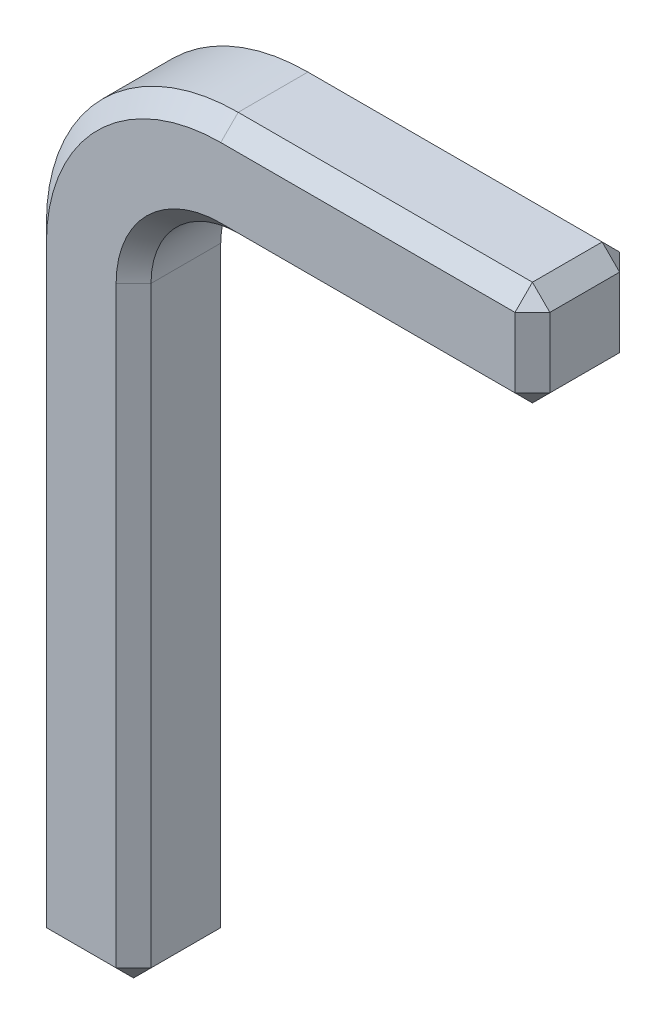
ISO-10303-21;
HEADER;
FILE_DESCRIPTION(('STEP AP214'),'2;1');
FILE_NAME('part.step','',(''),(''),'','','');
FILE_SCHEMA(('AUTOMOTIVE_DESIGN { 1 0 10303 214 1 1 1 1 }'));
ENDSEC;
DATA;
#1=APPLICATION_CONTEXT('core data for automotive mechanical design processes');
#2=APPLICATION_PROTOCOL_DEFINITION('international standard','automotive_design',2000,#1);
#3=PRODUCT_CONTEXT('',#1,'mechanical');
#4=PRODUCT('Part','Part','',(#3));
#5=PRODUCT_RELATED_PRODUCT_CATEGORY('part','',(#4));
#6=PRODUCT_DEFINITION_FORMATION('','',#4);
#7=PRODUCT_DEFINITION_CONTEXT('part definition',#1,'design');
#8=PRODUCT_DEFINITION('design','',#6,#7);
#9=PRODUCT_DEFINITION_SHAPE('','',#8);
#10=(LENGTH_UNIT() NAMED_UNIT(*) SI_UNIT(.MILLI.,.METRE.));
#11=(NAMED_UNIT(*) PLANE_ANGLE_UNIT() SI_UNIT($,.RADIAN.));
#12=(NAMED_UNIT(*) SI_UNIT($,.STERADIAN.) SOLID_ANGLE_UNIT());
#13=UNCERTAINTY_MEASURE_WITH_UNIT(LENGTH_MEASURE(1.E-05),#10,'distance_accuracy_value','');
#14=(GEOMETRIC_REPRESENTATION_CONTEXT(3) GLOBAL_UNCERTAINTY_ASSIGNED_CONTEXT((#13)) GLOBAL_UNIT_ASSIGNED_CONTEXT((#10,
#11,#12)) REPRESENTATION_CONTEXT('',''));
#15=CARTESIAN_POINT('',(0.,0.,0.));
#16=DIRECTION('',(0.,0.,1.));
#17=DIRECTION('',(1.,0.,0.));
#18=AXIS2_PLACEMENT_3D('',#15,#16,#17);
#19=CARTESIAN_POINT('',(-0.6,0.,0.3));
#20=DIRECTION('',(0.,1.,0.));
#21=DIRECTION('',(0.,0.,1.));
#22=AXIS2_PLACEMENT_3D('',#19,#20,#21);
#23=PLANE('',#22);
#24=DIRECTION('',(-1.,0.,0.));
#25=VECTOR('',#24,1.);
#26=CARTESIAN_POINT('',(-0.6,0.,0.200000000000001));
#27=LINE('',#26,#25);
#28=CARTESIAN_POINT('',(-0.0999999999999994,0.,0.200000000000001));
#29=VERTEX_POINT('',#28);
#30=CARTESIAN_POINT('',(-0.500000000000001,0.,0.200000000000001));
#31=VERTEX_POINT('',#30);
#32=EDGE_CURVE('E272',#29,#31,#27,.T.);
#33=ORIENTED_EDGE('',*,*,#32,.T.);
#34=DIRECTION('',(0.,0.,-1.));
#35=VECTOR('',#34,1.);
#36=CARTESIAN_POINT('',(-0.500000000000001,0.,0.3));
#37=LINE('',#36,#35);
#38=CARTESIAN_POINT('',(-0.500000000000001,0.,-0.200000000000001));
#39=VERTEX_POINT('',#38);
#40=EDGE_CURVE('E274',#31,#39,#37,.T.);
#41=ORIENTED_EDGE('',*,*,#40,.T.);
#42=DIRECTION('',(1.,0.,0.));
#43=VECTOR('',#42,1.);
#44=CARTESIAN_POINT('',(0.,0.,-0.200000000000001));
#45=LINE('',#44,#43);
#46=CARTESIAN_POINT('',(-0.0999999999999994,0.,-0.200000000000001));
#47=VERTEX_POINT('',#46);
#48=EDGE_CURVE('E270',#39,#47,#45,.T.);
#49=ORIENTED_EDGE('',*,*,#48,.T.);
#50=DIRECTION('',(0.,0.,1.));
#51=VECTOR('',#50,1.);
#52=CARTESIAN_POINT('',(-0.0999999999999994,0.,0.3));
#53=LINE('',#52,#51);
#54=EDGE_CURVE('E268',#47,#29,#53,.T.);
#55=ORIENTED_EDGE('',*,*,#54,.T.);
#56=EDGE_LOOP('',(#33,#41,#49,#55));
#57=FACE_BOUND('',#56,.T.);
#58=ADVANCED_FACE('F32',(#57),#23,.F.);
#59=CARTESIAN_POINT('',(0.,0.,0.3));
#60=DIRECTION('',(-1.,0.,0.));
#61=DIRECTION('',(0.,0.,1.));
#62=AXIS2_PLACEMENT_3D('',#59,#60,#61);
#63=PLANE('',#62);
#64=DIRECTION('',(0.,0.,-1.));
#65=VECTOR('',#64,1.);
#66=CARTESIAN_POINT('',(0.,0.0999999999999994,0.3));
#67=LINE('',#66,#65);
#68=CARTESIAN_POINT('',(0.,0.0999999999999994,0.200000000000001));
#69=VERTEX_POINT('',#68);
#70=CARTESIAN_POINT('',(0.,0.0999999999999994,-0.200000000000001));
#71=VERTEX_POINT('',#70);
#72=EDGE_CURVE('E206',#69,#71,#67,.T.);
#73=ORIENTED_EDGE('',*,*,#72,.T.);
#74=DIRECTION('',(0.,1.,0.));
#75=VECTOR('',#74,1.);
#76=CARTESIAN_POINT('',(0.,3.5,-0.200000000000001));
#77=LINE('',#76,#75);
#78=CARTESIAN_POINT('',(0.,3.5,-0.200000000000001));
#79=VERTEX_POINT('',#78);
#80=EDGE_CURVE('E190',#71,#79,#77,.T.);
#81=ORIENTED_EDGE('',*,*,#80,.T.);
#82=DIRECTION('',(0.,0.,-1.));
#83=VECTOR('',#82,1.);
#84=CARTESIAN_POINT('',(0.,3.5,0.3));
#85=LINE('',#84,#83);
#86=CARTESIAN_POINT('',(0.,3.5,0.200000000000001));
#87=VERTEX_POINT('',#86);
#88=EDGE_CURVE('E173',#87,#79,#85,.T.);
#89=ORIENTED_EDGE('',*,*,#88,.F.);
#90=DIRECTION('',(0.,-1.,0.));
#91=VECTOR('',#90,1.);
#92=CARTESIAN_POINT('',(0.,0.,0.200000000000001));
#93=LINE('',#92,#91);
#94=EDGE_CURVE('E187',#87,#69,#93,.T.);
#95=ORIENTED_EDGE('',*,*,#94,.T.);
#96=EDGE_LOOP('',(#73,#81,#89,#95));
#97=FACE_BOUND('',#96,.T.);
#98=ADVANCED_FACE('F185',(#97),#63,.F.);
#99=CARTESIAN_POINT('',(0.5,3.5,0.3));
#100=DIRECTION('',(0.,0.,-1.));
#101=DIRECTION('',(-1.,0.,0.));
#102=AXIS2_PLACEMENT_3D('',#99,#100,#101);
#103=CYLINDRICAL_SURFACE('',#102,0.5);
#104=ORIENTED_EDGE('',*,*,#88,.T.);
#105=CARTESIAN_POINT('',(0.5,3.5,-0.200000000000001));
#106=DIRECTION('',(0.,0.,-1.));
#107=DIRECTION('',(-1.,0.,0.));
#108=AXIS2_PLACEMENT_3D('',#105,#106,#107);
#109=CIRCLE('',#108,0.5);
#110=CARTESIAN_POINT('',(0.5,4.,-0.200000000000001));
#111=VERTEX_POINT('',#110);
#112=EDGE_CURVE('E180',#79,#111,#109,.T.);
#113=ORIENTED_EDGE('',*,*,#112,.T.);
#114=DIRECTION('',(0.,0.,-1.));
#115=VECTOR('',#114,1.);
#116=CARTESIAN_POINT('',(0.5,4.,0.3));
#117=LINE('',#116,#115);
#118=CARTESIAN_POINT('',(0.5,4.,0.200000000000001));
#119=VERTEX_POINT('',#118);
#120=EDGE_CURVE('E175',#119,#111,#117,.T.);
#121=ORIENTED_EDGE('',*,*,#120,.F.);
#122=CARTESIAN_POINT('',(0.5,3.5,0.200000000000001));
#123=DIRECTION('',(0.,0.,-1.));
#124=DIRECTION('',(-1.,0.,0.));
#125=AXIS2_PLACEMENT_3D('',#122,#123,#124);
#126=CIRCLE('',#125,0.5);
#127=EDGE_CURVE('E170',#119,#87,#126,.F.);
#128=ORIENTED_EDGE('',*,*,#127,.T.);
#129=EDGE_LOOP('',(#104,#113,#121,#128));
#130=FACE_BOUND('',#129,.T.);
#131=ADVANCED_FACE('F172',(#130),#103,.F.);
#132=CARTESIAN_POINT('',(0.5,4.,0.3));
#133=DIRECTION('',(0.,1.,0.));
#134=DIRECTION('',(0.,0.,1.));
#135=AXIS2_PLACEMENT_3D('',#132,#133,#134);
#136=PLANE('',#135);
#137=ORIENTED_EDGE('',*,*,#120,.T.);
#138=DIRECTION('',(1.,0.,0.));
#139=VECTOR('',#138,1.);
#140=CARTESIAN_POINT('',(2.28769588706264,4.,-0.200000000000001));
#141=LINE('',#140,#139);
#142=CARTESIAN_POINT('',(2.18769588706264,4.,-0.200000000000001));
#143=VERTEX_POINT('',#142);
#144=EDGE_CURVE('E233',#111,#143,#141,.T.);
#145=ORIENTED_EDGE('',*,*,#144,.T.);
#146=DIRECTION('',(0.,0.,1.));
#147=VECTOR('',#146,1.);
#148=CARTESIAN_POINT('',(2.18769588706264,4.,0.3));
#149=LINE('',#148,#147);
#150=CARTESIAN_POINT('',(2.18769588706264,4.,0.200000000000001));
#151=VERTEX_POINT('',#150);
#152=EDGE_CURVE('E229',#143,#151,#149,.T.);
#153=ORIENTED_EDGE('',*,*,#152,.T.);
#154=DIRECTION('',(-1.,0.,0.));
#155=VECTOR('',#154,1.);
#156=CARTESIAN_POINT('',(0.5,4.,0.200000000000001));
#157=LINE('',#156,#155);
#158=EDGE_CURVE('E231',#151,#119,#157,.T.);
#159=ORIENTED_EDGE('',*,*,#158,.T.);
#160=EDGE_LOOP('',(#137,#145,#153,#159));
#161=FACE_BOUND('',#160,.T.);
#162=ADVANCED_FACE('F380',(#161),#136,.F.);
#163=CARTESIAN_POINT('',(2.28769588706264,4.6,0.3));
#164=DIRECTION('',(-1.,0.,0.));
#165=DIRECTION('',(0.,0.,1.));
#166=AXIS2_PLACEMENT_3D('',#163,#164,#165);
#167=PLANE('',#166);
#168=DIRECTION('',(0.,-1.,0.));
#169=VECTOR('',#168,1.);
#170=CARTESIAN_POINT('',(2.28769588706264,4.6,0.200000000000001));
#171=LINE('',#170,#169);
#172=CARTESIAN_POINT('',(2.28769588706264,4.5,0.200000000000001));
#173=VERTEX_POINT('',#172);
#174=CARTESIAN_POINT('',(2.28769588706264,4.1,0.200000000000001));
#175=VERTEX_POINT('',#174);
#176=EDGE_CURVE('E41',#173,#175,#171,.T.);
#177=ORIENTED_EDGE('',*,*,#176,.T.);
#178=DIRECTION('',(0.,0.,-1.));
#179=VECTOR('',#178,1.);
#180=CARTESIAN_POINT('',(2.28769588706264,4.1,0.3));
#181=LINE('',#180,#179);
#182=CARTESIAN_POINT('',(2.28769588706264,4.1,-0.200000000000001));
#183=VERTEX_POINT('',#182);
#184=EDGE_CURVE('E11',#175,#183,#181,.T.);
#185=ORIENTED_EDGE('',*,*,#184,.T.);
#186=DIRECTION('',(0.,1.,0.));
#187=VECTOR('',#186,1.);
#188=CARTESIAN_POINT('',(2.28769588706264,4.6,-0.200000000000001));
#189=LINE('',#188,#187);
#190=CARTESIAN_POINT('',(2.28769588706264,4.5,-0.200000000000001));
#191=VERTEX_POINT('',#190);
#192=EDGE_CURVE('E277',#183,#191,#189,.T.);
#193=ORIENTED_EDGE('',*,*,#192,.T.);
#194=DIRECTION('',(0.,0.,1.));
#195=VECTOR('',#194,1.);
#196=CARTESIAN_POINT('',(2.28769588706264,4.5,0.3));
#197=LINE('',#196,#195);
#198=EDGE_CURVE('E52',#191,#173,#197,.T.);
#199=ORIENTED_EDGE('',*,*,#198,.T.);
#200=EDGE_LOOP('',(#177,#185,#193,#199));
#201=FACE_BOUND('',#200,.T.);
#202=ADVANCED_FACE('F580',(#201),#167,.F.);
#203=CARTESIAN_POINT('',(0.5,4.6,0.3));
#204=DIRECTION('',(0.,-1.,0.));
#205=DIRECTION('',(0.,0.,-1.));
#206=AXIS2_PLACEMENT_3D('',#203,#204,#205);
#207=PLANE('',#206);
#208=DIRECTION('',(0.,0.,-1.));
#209=VECTOR('',#208,1.);
#210=CARTESIAN_POINT('',(2.18769588706264,4.6,0.3));
#211=LINE('',#210,#209);
#212=CARTESIAN_POINT('',(2.18769588706264,4.6,0.200000000000001));
#213=VERTEX_POINT('',#212);
#214=CARTESIAN_POINT('',(2.18769588706264,4.6,-0.200000000000001));
#215=VERTEX_POINT('',#214);
#216=EDGE_CURVE('E235',#213,#215,#211,.T.);
#217=ORIENTED_EDGE('',*,*,#216,.T.);
#218=DIRECTION('',(-1.,0.,0.));
#219=VECTOR('',#218,1.);
#220=CARTESIAN_POINT('',(0.5,4.6,-0.200000000000001));
#221=LINE('',#220,#219);
#222=CARTESIAN_POINT('',(0.5,4.6,-0.200000000000001));
#223=VERTEX_POINT('',#222);
#224=EDGE_CURVE('E239',#215,#223,#221,.T.);
#225=ORIENTED_EDGE('',*,*,#224,.T.);
#226=DIRECTION('',(0.,0.,-1.));
#227=VECTOR('',#226,1.);
#228=CARTESIAN_POINT('',(0.5,4.6,0.3));
#229=LINE('',#228,#227);
#230=CARTESIAN_POINT('',(0.5,4.6,0.200000000000001));
#231=VERTEX_POINT('',#230);
#232=EDGE_CURVE('E371',#231,#223,#229,.T.);
#233=ORIENTED_EDGE('',*,*,#232,.F.);
#234=DIRECTION('',(1.,0.,0.));
#235=VECTOR('',#234,1.);
#236=CARTESIAN_POINT('',(0.5,4.6,0.200000000000001));
#237=LINE('',#236,#235);
#238=EDGE_CURVE('E237',#231,#213,#237,.T.);
#239=ORIENTED_EDGE('',*,*,#238,.T.);
#240=EDGE_LOOP('',(#217,#225,#233,#239));
#241=FACE_BOUND('',#240,.T.);
#242=ADVANCED_FACE('F445',(#241),#207,.F.);
#243=CARTESIAN_POINT('',(0.5,3.5,0.3));
#244=DIRECTION('',(0.,0.,-1.));
#245=DIRECTION('',(-1.,0.,0.));
#246=AXIS2_PLACEMENT_3D('',#243,#244,#245);
#247=CYLINDRICAL_SURFACE('',#246,1.1);
#248=ORIENTED_EDGE('',*,*,#232,.T.);
#249=CARTESIAN_POINT('',(0.5,3.5,-0.200000000000001));
#250=DIRECTION('',(0.,0.,-1.));
#251=DIRECTION('',(-1.,0.,0.));
#252=AXIS2_PLACEMENT_3D('',#249,#250,#251);
#253=CIRCLE('',#252,1.1);
#254=CARTESIAN_POINT('',(-0.6,3.5,-0.200000000000001));
#255=VERTEX_POINT('',#254);
#256=EDGE_CURVE('E244',#223,#255,#253,.F.);
#257=ORIENTED_EDGE('',*,*,#256,.T.);
#258=DIRECTION('',(0.,0.,-1.));
#259=VECTOR('',#258,1.);
#260=CARTESIAN_POINT('',(-0.6,3.5,0.3));
#261=LINE('',#260,#259);
#262=CARTESIAN_POINT('',(-0.6,3.5,0.200000000000001));
#263=VERTEX_POINT('',#262);
#264=EDGE_CURVE('E365',#263,#255,#261,.T.);
#265=ORIENTED_EDGE('',*,*,#264,.F.);
#266=CARTESIAN_POINT('',(0.5,3.5,0.200000000000001));
#267=DIRECTION('',(0.,0.,-1.));
#268=DIRECTION('',(-1.,0.,0.));
#269=AXIS2_PLACEMENT_3D('',#266,#267,#268);
#270=CIRCLE('',#269,1.1);
#271=EDGE_CURVE('E242',#263,#231,#270,.T.);
#272=ORIENTED_EDGE('',*,*,#271,.T.);
#273=EDGE_LOOP('',(#248,#257,#265,#272));
#274=FACE_BOUND('',#273,.T.);
#275=ADVANCED_FACE('F442',(#274),#247,.T.);
#276=CARTESIAN_POINT('',(-0.6,0.,0.3));
#277=DIRECTION('',(1.,0.,0.));
#278=DIRECTION('',(0.,0.,-1.));
#279=AXIS2_PLACEMENT_3D('',#276,#277,#278);
#280=PLANE('',#279);
#281=ORIENTED_EDGE('',*,*,#264,.T.);
#282=DIRECTION('',(0.,-1.,0.));
#283=VECTOR('',#282,1.);
#284=CARTESIAN_POINT('',(-0.6,0.,-0.200000000000001));
#285=LINE('',#284,#283);
#286=CARTESIAN_POINT('',(-0.6,0.0999999999999994,-0.200000000000001));
#287=VERTEX_POINT('',#286);
#288=EDGE_CURVE('E250',#255,#287,#285,.T.);
#289=ORIENTED_EDGE('',*,*,#288,.T.);
#290=DIRECTION('',(0.,0.,1.));
#291=VECTOR('',#290,1.);
#292=CARTESIAN_POINT('',(-0.6,0.0999999999999994,0.3));
#293=LINE('',#292,#291);
#294=CARTESIAN_POINT('',(-0.6,0.0999999999999994,0.200000000000001));
#295=VERTEX_POINT('',#294);
#296=EDGE_CURVE('E246',#287,#295,#293,.T.);
#297=ORIENTED_EDGE('',*,*,#296,.T.);
#298=DIRECTION('',(0.,1.,0.));
#299=VECTOR('',#298,1.);
#300=CARTESIAN_POINT('',(-0.6,0.,0.200000000000001));
#301=LINE('',#300,#299);
#302=EDGE_CURVE('E248',#295,#263,#301,.T.);
#303=ORIENTED_EDGE('',*,*,#302,.T.);
#304=EDGE_LOOP('',(#281,#289,#297,#303));
#305=FACE_BOUND('',#304,.T.);
#306=ADVANCED_FACE('F461',(#305),#280,.F.);
#307=CARTESIAN_POINT('',(0.5,3.5,0.3));
#308=DIRECTION('',(0.,0.,-1.));
#309=DIRECTION('',(-1.,0.,0.));
#310=AXIS2_PLACEMENT_3D('',#307,#308,#309);
#311=PLANE('',#310);
#312=CARTESIAN_POINT('',(0.5,3.5,0.3));
#313=DIRECTION('',(0.,0.,-1.));
#314=DIRECTION('',(-1.,0.,0.));
#315=AXIS2_PLACEMENT_3D('',#312,#313,#314);
#316=CIRCLE('',#315,1.);
#317=CARTESIAN_POINT('',(0.5,4.5,0.3));
#318=VERTEX_POINT('',#317);
#319=CARTESIAN_POINT('',(-0.5,3.5,0.3));
#320=VERTEX_POINT('',#319);
#321=EDGE_CURVE('E263',#318,#320,#316,.F.);
#322=ORIENTED_EDGE('',*,*,#321,.T.);
#323=DIRECTION('',(0.,-1.,0.));
#324=VECTOR('',#323,1.);
#325=CARTESIAN_POINT('',(-0.5,3.5,0.3));
#326=LINE('',#325,#324);
#327=CARTESIAN_POINT('',(-0.5,0.0999999999999994,0.3));
#328=VERTEX_POINT('',#327);
#329=EDGE_CURVE('E265',#320,#328,#326,.T.);
#330=ORIENTED_EDGE('',*,*,#329,.T.);
#331=DIRECTION('',(1.,0.,0.));
#332=VECTOR('',#331,1.);
#333=CARTESIAN_POINT('',(0.5,0.0999999999999994,0.3));
#334=LINE('',#333,#332);
#335=CARTESIAN_POINT('',(-0.0999999999999994,0.0999999999999994,0.3));
#336=VERTEX_POINT('',#335);
#337=EDGE_CURVE('E259',#328,#336,#334,.T.);
#338=ORIENTED_EDGE('',*,*,#337,.T.);
#339=DIRECTION('',(0.,1.,0.));
#340=VECTOR('',#339,1.);
#341=CARTESIAN_POINT('',(-0.0999999999999994,3.5,0.3));
#342=LINE('',#341,#340);
#343=CARTESIAN_POINT('',(-0.0999999999999994,3.5,0.3));
#344=VERTEX_POINT('',#343);
#345=EDGE_CURVE('E257',#336,#344,#342,.T.);
#346=ORIENTED_EDGE('',*,*,#345,.T.);
#347=CARTESIAN_POINT('',(0.5,3.5,0.3));
#348=DIRECTION('',(0.,0.,-1.));
#349=DIRECTION('',(-1.,0.,0.));
#350=AXIS2_PLACEMENT_3D('',#347,#348,#349);
#351=CIRCLE('',#350,0.599999999999999);
#352=CARTESIAN_POINT('',(0.5,4.1,0.3));
#353=VERTEX_POINT('',#352);
#354=EDGE_CURVE('E196',#344,#353,#351,.T.);
#355=ORIENTED_EDGE('',*,*,#354,.T.);
#356=DIRECTION('',(1.,0.,0.));
#357=VECTOR('',#356,1.);
#358=CARTESIAN_POINT('',(0.5,4.1,0.3));
#359=LINE('',#358,#357);
#360=CARTESIAN_POINT('',(2.18769588706264,4.1,0.3));
#361=VERTEX_POINT('',#360);
#362=EDGE_CURVE('E254',#353,#361,#359,.T.);
#363=ORIENTED_EDGE('',*,*,#362,.T.);
#364=DIRECTION('',(0.,1.,0.));
#365=VECTOR('',#364,1.);
#366=CARTESIAN_POINT('',(2.18769588706264,3.5,0.3));
#367=LINE('',#366,#365);
#368=CARTESIAN_POINT('',(2.18769588706264,4.5,0.3));
#369=VERTEX_POINT('',#368);
#370=EDGE_CURVE('E252',#361,#369,#367,.T.);
#371=ORIENTED_EDGE('',*,*,#370,.T.);
#372=DIRECTION('',(-1.,0.,0.));
#373=VECTOR('',#372,1.);
#374=CARTESIAN_POINT('',(0.5,4.5,0.3));
#375=LINE('',#374,#373);
#376=EDGE_CURVE('E261',#369,#318,#375,.T.);
#377=ORIENTED_EDGE('',*,*,#376,.T.);
#378=EDGE_LOOP('',(#322,#330,#338,#346,#355,#363,#371,#377));
#379=FACE_BOUND('',#378,.T.);
#380=ADVANCED_FACE('F436',(#379),#311,.F.);
#381=CARTESIAN_POINT('',(0.5,3.5,-0.3));
#382=DIRECTION('',(0.,0.,-1.));
#383=DIRECTION('',(-1.,0.,0.));
#384=AXIS2_PLACEMENT_3D('',#381,#382,#383);
#385=PLANE('',#384);
#386=DIRECTION('',(0.,1.,0.));
#387=VECTOR('',#386,1.);
#388=CARTESIAN_POINT('',(-0.5,3.5,-0.3));
#389=LINE('',#388,#387);
#390=CARTESIAN_POINT('',(-0.5,0.0999999999999994,-0.3));
#391=VERTEX_POINT('',#390);
#392=CARTESIAN_POINT('',(-0.5,3.5,-0.3));
#393=VERTEX_POINT('',#392);
#394=EDGE_CURVE('E225',#391,#393,#389,.T.);
#395=ORIENTED_EDGE('',*,*,#394,.T.);
#396=CARTESIAN_POINT('',(0.5,3.5,-0.3));
#397=DIRECTION('',(0.,0.,-1.));
#398=DIRECTION('',(-1.,0.,0.));
#399=AXIS2_PLACEMENT_3D('',#396,#397,#398);
#400=CIRCLE('',#399,1.);
#401=CARTESIAN_POINT('',(0.5,4.5,-0.3));
#402=VERTEX_POINT('',#401);
#403=EDGE_CURVE('E181',#393,#402,#400,.T.);
#404=ORIENTED_EDGE('',*,*,#403,.T.);
#405=DIRECTION('',(1.,0.,0.));
#406=VECTOR('',#405,1.);
#407=CARTESIAN_POINT('',(2.28769588706264,4.5,-0.3));
#408=LINE('',#407,#406);
#409=CARTESIAN_POINT('',(2.18769588706264,4.5,-0.3));
#410=VERTEX_POINT('',#409);
#411=EDGE_CURVE('E214',#402,#410,#408,.T.);
#412=ORIENTED_EDGE('',*,*,#411,.T.);
#413=DIRECTION('',(0.,-1.,0.));
#414=VECTOR('',#413,1.);
#415=CARTESIAN_POINT('',(2.18769588706264,4.,-0.3));
#416=LINE('',#415,#414);
#417=CARTESIAN_POINT('',(2.18769588706264,4.1,-0.3));
#418=VERTEX_POINT('',#417);
#419=EDGE_CURVE('E212',#410,#418,#416,.T.);
#420=ORIENTED_EDGE('',*,*,#419,.T.);
#421=DIRECTION('',(-1.,0.,0.));
#422=VECTOR('',#421,1.);
#423=CARTESIAN_POINT('',(0.5,4.1,-0.3));
#424=LINE('',#423,#422);
#425=CARTESIAN_POINT('',(0.5,4.1,-0.3));
#426=VERTEX_POINT('',#425);
#427=EDGE_CURVE('E216',#418,#426,#424,.T.);
#428=ORIENTED_EDGE('',*,*,#427,.T.);
#429=CARTESIAN_POINT('',(0.5,3.5,-0.3));
#430=DIRECTION('',(0.,0.,-1.));
#431=DIRECTION('',(-1.,0.,0.));
#432=AXIS2_PLACEMENT_3D('',#429,#430,#431);
#433=CIRCLE('',#432,0.599999999999999);
#434=CARTESIAN_POINT('',(-0.0999999999999994,3.5,-0.3));
#435=VERTEX_POINT('',#434);
#436=EDGE_CURVE('E218',#426,#435,#433,.F.);
#437=ORIENTED_EDGE('',*,*,#436,.T.);
#438=DIRECTION('',(0.,-1.,0.));
#439=VECTOR('',#438,1.);
#440=CARTESIAN_POINT('',(-0.0999999999999994,0.,-0.3));
#441=LINE('',#440,#439);
#442=CARTESIAN_POINT('',(-0.0999999999999994,0.0999999999999994,-0.3));
#443=VERTEX_POINT('',#442);
#444=EDGE_CURVE('E220',#435,#443,#441,.T.);
#445=ORIENTED_EDGE('',*,*,#444,.T.);
#446=DIRECTION('',(-1.,0.,0.));
#447=VECTOR('',#446,1.);
#448=CARTESIAN_POINT('',(-0.6,0.0999999999999994,-0.3));
#449=LINE('',#448,#447);
#450=EDGE_CURVE('E223',#443,#391,#449,.T.);
#451=ORIENTED_EDGE('',*,*,#450,.T.);
#452=EDGE_LOOP('',(#395,#404,#412,#420,#428,#437,#445,#451));
#453=FACE_BOUND('',#452,.T.);
#454=ADVANCED_FACE('F395',(#453),#385,.T.);
#455=CARTESIAN_POINT('',(0.5,4.5,0.3));
#456=DIRECTION('',(0.,-0.707106781186548,-0.707106781186548));
#457=DIRECTION('',(-1.,0.,0.));
#458=AXIS2_PLACEMENT_3D('',#455,#456,#457);
#459=PLANE('',#458);
#460=DIRECTION('',(0.,0.707106781186547,-0.707106781186547));
#461=VECTOR('',#460,1.);
#462=CARTESIAN_POINT('',(2.18769588706264,4.6,0.200000000000001));
#463=LINE('',#462,#461);
#464=EDGE_CURVE('E358',#213,#369,#463,.F.);
#465=ORIENTED_EDGE('',*,*,#464,.F.);
#466=ORIENTED_EDGE('',*,*,#238,.F.);
#467=DIRECTION('',(0.,0.707106781186548,-0.707106781186548));
#468=VECTOR('',#467,1.);
#469=CARTESIAN_POINT('',(0.5,4.5,0.3));
#470=LINE('',#469,#468);
#471=EDGE_CURVE('E36',#318,#231,#470,.T.);
#472=ORIENTED_EDGE('',*,*,#471,.F.);
#473=ORIENTED_EDGE('',*,*,#376,.F.);
#474=EDGE_LOOP('',(#465,#466,#472,#473));
#475=FACE_BOUND('',#474,.T.);
#476=ADVANCED_FACE('F34',(#475),#459,.F.);
#477=CARTESIAN_POINT('',(0.5,3.5,0.3));
#478=DIRECTION('',(0.,0.,-1.));
#479=DIRECTION('',(-1.,0.,0.));
#480=AXIS2_PLACEMENT_3D('',#477,#478,#479);
#481=CONICAL_SURFACE('',#480,1.,0.785398163397448);
#482=ORIENTED_EDGE('',*,*,#471,.T.);
#483=ORIENTED_EDGE('',*,*,#271,.F.);
#484=DIRECTION('',(-0.707106781186548,0.,-0.707106781186547));
#485=VECTOR('',#484,1.);
#486=CARTESIAN_POINT('',(-0.5,3.5,0.3));
#487=LINE('',#486,#485);
#488=EDGE_CURVE('E356',#320,#263,#487,.T.);
#489=ORIENTED_EDGE('',*,*,#488,.F.);
#490=ORIENTED_EDGE('',*,*,#321,.F.);
#491=EDGE_LOOP('',(#482,#483,#489,#490));
#492=FACE_BOUND('',#491,.T.);
#493=ADVANCED_FACE('F439',(#492),#481,.T.);
#494=CARTESIAN_POINT('',(2.18769588706264,4.6,0.200000000000001));
#495=DIRECTION('',(0.577350269189626,0.577350269189626,0.577350269189626));
#496=DIRECTION('',(0.707106781186548,0.,-0.707106781186548));
#497=AXIS2_PLACEMENT_3D('',#494,#495,#496);
#498=PLANE('',#497);
#499=DIRECTION('',(0.707106781186547,-0.707106781186547,0.));
#500=VECTOR('',#499,1.);
#501=CARTESIAN_POINT('',(2.18769588706264,4.6,0.200000000000001));
#502=LINE('',#501,#500);
#503=EDGE_CURVE('E351',#213,#173,#502,.T.);
#504=ORIENTED_EDGE('',*,*,#503,.F.);
#505=ORIENTED_EDGE('',*,*,#464,.T.);
#506=DIRECTION('',(-0.707106781186547,0.,0.707106781186547));
#507=VECTOR('',#506,1.);
#508=CARTESIAN_POINT('',(2.23769588706264,4.5,0.25));
#509=LINE('',#508,#507);
#510=EDGE_CURVE('E353',#173,#369,#509,.T.);
#511=ORIENTED_EDGE('',*,*,#510,.F.);
#512=EDGE_LOOP('',(#504,#505,#511));
#513=FACE_BOUND('',#512,.T.);
#514=ADVANCED_FACE('F449',(#513),#498,.T.);
#515=CARTESIAN_POINT('',(-0.5,3.5,0.3));
#516=DIRECTION('',(0.707106781186547,0.,-0.707106781186548));
#517=DIRECTION('',(0.,-1.,0.));
#518=AXIS2_PLACEMENT_3D('',#515,#516,#517);
#519=PLANE('',#518);
#520=ORIENTED_EDGE('',*,*,#488,.T.);
#521=ORIENTED_EDGE('',*,*,#302,.F.);
#522=DIRECTION('',(0.707106781186548,0.,0.707106781186547));
#523=VECTOR('',#522,1.);
#524=CARTESIAN_POINT('',(-0.5,0.0999999999999994,0.3));
#525=LINE('',#524,#523);
#526=EDGE_CURVE('E345',#328,#295,#525,.F.);
#527=ORIENTED_EDGE('',*,*,#526,.F.);
#528=ORIENTED_EDGE('',*,*,#329,.F.);
#529=EDGE_LOOP('',(#520,#521,#527,#528));
#530=FACE_BOUND('',#529,.T.);
#531=ADVANCED_FACE('F434',(#530),#519,.F.);
#532=CARTESIAN_POINT('',(0.5,4.1,0.3));
#533=DIRECTION('',(0.,0.707106781186548,-0.707106781186548));
#534=DIRECTION('',(1.,0.,0.));
#535=AXIS2_PLACEMENT_3D('',#532,#533,#534);
#536=PLANE('',#535);
#537=DIRECTION('',(0.,0.707106781186547,0.707106781186547));
#538=VECTOR('',#537,1.);
#539=CARTESIAN_POINT('',(2.18769588706264,4.1,0.3));
#540=LINE('',#539,#538);
#541=EDGE_CURVE('E340',#361,#151,#540,.F.);
#542=ORIENTED_EDGE('',*,*,#541,.F.);
#543=ORIENTED_EDGE('',*,*,#362,.F.);
#544=DIRECTION('',(0.,0.707106781186548,0.707106781186548));
#545=VECTOR('',#544,1.);
#546=CARTESIAN_POINT('',(0.5,4.,0.200000000000001));
#547=LINE('',#546,#545);
#548=EDGE_CURVE('E343',#119,#353,#547,.T.);
#549=ORIENTED_EDGE('',*,*,#548,.F.);
#550=ORIENTED_EDGE('',*,*,#158,.F.);
#551=EDGE_LOOP('',(#542,#543,#549,#550));
#552=FACE_BOUND('',#551,.T.);
#553=ADVANCED_FACE('F540',(#552),#536,.F.);
#554=CARTESIAN_POINT('',(2.18769588706264,3.5,0.3));
#555=DIRECTION('',(-0.707106781186548,0.,-0.707106781186548));
#556=DIRECTION('',(0.,1.,0.));
#557=AXIS2_PLACEMENT_3D('',#554,#555,#556);
#558=PLANE('',#557);
#559=ORIENTED_EDGE('',*,*,#510,.T.);
#560=ORIENTED_EDGE('',*,*,#370,.F.);
#561=DIRECTION('',(0.707106781186547,0.,-0.707106781186547));
#562=VECTOR('',#561,1.);
#563=CARTESIAN_POINT('',(2.18769588706264,4.1,0.3));
#564=LINE('',#563,#562);
#565=EDGE_CURVE('E337',#175,#361,#564,.F.);
#566=ORIENTED_EDGE('',*,*,#565,.F.);
#567=ORIENTED_EDGE('',*,*,#176,.F.);
#568=EDGE_LOOP('',(#559,#560,#566,#567));
#569=FACE_BOUND('',#568,.T.);
#570=ADVANCED_FACE('F537',(#569),#558,.F.);
#571=CARTESIAN_POINT('',(2.18769588706264,4.6,0.3));
#572=DIRECTION('',(-0.707106781186548,-0.707106781186548,0.));
#573=DIRECTION('',(0.,0.,-1.));
#574=AXIS2_PLACEMENT_3D('',#571,#572,#573);
#575=PLANE('',#574);
#576=ORIENTED_EDGE('',*,*,#503,.T.);
#577=ORIENTED_EDGE('',*,*,#198,.F.);
#578=DIRECTION('',(-0.707106781186547,0.707106781186547,0.));
#579=VECTOR('',#578,1.);
#580=CARTESIAN_POINT('',(2.23769588706264,4.55,-0.200000000000001));
#581=LINE('',#580,#579);
#582=EDGE_CURVE('E334',#215,#191,#581,.F.);
#583=ORIENTED_EDGE('',*,*,#582,.F.);
#584=ORIENTED_EDGE('',*,*,#216,.F.);
#585=EDGE_LOOP('',(#576,#577,#583,#584));
#586=FACE_BOUND('',#585,.T.);
#587=ADVANCED_FACE('F452',(#586),#575,.F.);
#588=CARTESIAN_POINT('',(0.5,4.6,-0.200000000000001));
#589=DIRECTION('',(0.,0.707106781186548,-0.707106781186548));
#590=DIRECTION('',(1.,0.,0.));
#591=AXIS2_PLACEMENT_3D('',#588,#589,#590);
#592=PLANE('',#591);
#593=DIRECTION('',(0.,0.707106781186547,0.707106781186547));
#594=VECTOR('',#593,1.);
#595=CARTESIAN_POINT('',(2.18769588706264,4.5,-0.3));
#596=LINE('',#595,#594);
#597=EDGE_CURVE('E331',#410,#215,#596,.T.);
#598=ORIENTED_EDGE('',*,*,#597,.F.);
#599=ORIENTED_EDGE('',*,*,#411,.F.);
#600=DIRECTION('',(0.,-0.707106781186548,-0.707106781186548));
#601=VECTOR('',#600,1.);
#602=CARTESIAN_POINT('',(0.5,4.6,-0.200000000000001));
#603=LINE('',#602,#601);
#604=EDGE_CURVE('E348',#223,#402,#603,.T.);
#605=ORIENTED_EDGE('',*,*,#604,.F.);
#606=ORIENTED_EDGE('',*,*,#224,.F.);
#607=EDGE_LOOP('',(#598,#599,#605,#606));
#608=FACE_BOUND('',#607,.T.);
#609=ADVANCED_FACE('F456',(#608),#592,.T.);
#610=CARTESIAN_POINT('',(0.5,3.5,-0.200000000000001));
#611=DIRECTION('',(0.,0.,1.));
#612=DIRECTION('',(1.,0.,0.));
#613=AXIS2_PLACEMENT_3D('',#610,#611,#612);
#614=CONICAL_SURFACE('',#613,1.1,0.785398163397448);
#615=ORIENTED_EDGE('',*,*,#604,.T.);
#616=ORIENTED_EDGE('',*,*,#403,.F.);
#617=DIRECTION('',(0.707106781186548,0.,-0.707106781186548));
#618=VECTOR('',#617,1.);
#619=CARTESIAN_POINT('',(-0.6,3.5,-0.200000000000001));
#620=LINE('',#619,#618);
#621=EDGE_CURVE('E328',#255,#393,#620,.T.);
#622=ORIENTED_EDGE('',*,*,#621,.F.);
#623=ORIENTED_EDGE('',*,*,#256,.F.);
#624=EDGE_LOOP('',(#615,#616,#622,#623));
#625=FACE_BOUND('',#624,.T.);
#626=ADVANCED_FACE('F460',(#625),#614,.T.);
#627=CARTESIAN_POINT('',(-0.5,0.0999999999999994,0.3));
#628=DIRECTION('',(-0.577350269189626,-0.577350269189626,0.577350269189626));
#629=DIRECTION('',(0.707106781186548,0.,0.707106781186547));
#630=AXIS2_PLACEMENT_3D('',#627,#628,#629);
#631=PLANE('',#630);
#632=DIRECTION('',(0.,-0.707106781186547,-0.707106781186547));
#633=VECTOR('',#632,1.);
#634=CARTESIAN_POINT('',(-0.5,0.0999999999999994,0.3));
#635=LINE('',#634,#633);
#636=EDGE_CURVE('E199',#328,#31,#635,.T.);
#637=ORIENTED_EDGE('',*,*,#636,.F.);
#638=ORIENTED_EDGE('',*,*,#526,.T.);
#639=DIRECTION('',(-0.707106781186548,0.707106781186548,0.));
#640=VECTOR('',#639,1.);
#641=CARTESIAN_POINT('',(-0.55,0.0499999999999996,0.200000000000001));
#642=LINE('',#641,#640);
#643=EDGE_CURVE('E325',#31,#295,#642,.T.);
#644=ORIENTED_EDGE('',*,*,#643,.F.);
#645=EDGE_LOOP('',(#637,#638,#644));
#646=FACE_BOUND('',#645,.T.);
#647=ADVANCED_FACE('F430',(#646),#631,.T.);
#648=CARTESIAN_POINT('',(0.5,3.5,0.3));
#649=DIRECTION('',(0.,0.,1.));
#650=DIRECTION('',(1.,0.,0.));
#651=AXIS2_PLACEMENT_3D('',#648,#649,#650);
#652=CONICAL_SURFACE('',#651,0.599999999999999,0.785398163397448);
#653=ORIENTED_EDGE('',*,*,#548,.T.);
#654=ORIENTED_EDGE('',*,*,#354,.F.);
#655=DIRECTION('',(-0.707106781186548,0.,0.707106781186548));
#656=VECTOR('',#655,1.);
#657=CARTESIAN_POINT('',(0.,3.5,0.200000000000001));
#658=LINE('',#657,#656);
#659=EDGE_CURVE('E194',#87,#344,#658,.T.);
#660=ORIENTED_EDGE('',*,*,#659,.F.);
#661=ORIENTED_EDGE('',*,*,#127,.F.);
#662=EDGE_LOOP('',(#653,#654,#660,#661));
#663=FACE_BOUND('',#662,.T.);
#664=ADVANCED_FACE('F195',(#663),#652,.F.);
#665=CARTESIAN_POINT('',(2.18769588706264,4.1,0.3));
#666=DIRECTION('',(0.577350269189626,-0.577350269189626,0.577350269189626));
#667=DIRECTION('',(0.707106781186548,0.,-0.707106781186548));
#668=AXIS2_PLACEMENT_3D('',#665,#666,#667);
#669=PLANE('',#668);
#670=ORIENTED_EDGE('',*,*,#565,.T.);
#671=ORIENTED_EDGE('',*,*,#541,.T.);
#672=DIRECTION('',(-0.707106781186547,-0.707106781186547,0.));
#673=VECTOR('',#672,1.);
#674=CARTESIAN_POINT('',(2.23769588706264,4.05,0.200000000000001));
#675=LINE('',#674,#673);
#676=EDGE_CURVE('E200',#175,#151,#675,.T.);
#677=ORIENTED_EDGE('',*,*,#676,.F.);
#678=EDGE_LOOP('',(#670,#671,#677));
#679=FACE_BOUND('',#678,.T.);
#680=ADVANCED_FACE('F522',(#679),#669,.T.);
#681=CARTESIAN_POINT('',(2.18769588706264,4.5,-0.3));
#682=DIRECTION('',(0.577350269189626,0.577350269189626,-0.577350269189626));
#683=DIRECTION('',(-0.707106781186548,0.,-0.707106781186548));
#684=AXIS2_PLACEMENT_3D('',#681,#682,#683);
#685=PLANE('',#684);
#686=ORIENTED_EDGE('',*,*,#597,.T.);
#687=ORIENTED_EDGE('',*,*,#582,.T.);
#688=DIRECTION('',(-0.707106781186547,0.,-0.707106781186547));
#689=VECTOR('',#688,1.);
#690=CARTESIAN_POINT('',(2.18769588706264,4.5,-0.3));
#691=LINE('',#690,#689);
#692=EDGE_CURVE('E318',#410,#191,#691,.F.);
#693=ORIENTED_EDGE('',*,*,#692,.F.);
#694=EDGE_LOOP('',(#686,#687,#693));
#695=FACE_BOUND('',#694,.T.);
#696=ADVANCED_FACE('F519',(#695),#685,.T.);
#697=CARTESIAN_POINT('',(-0.6,0.,-0.200000000000001));
#698=DIRECTION('',(-0.707106781186547,0.,-0.707106781186548));
#699=DIRECTION('',(0.,1.,0.));
#700=AXIS2_PLACEMENT_3D('',#697,#698,#699);
#701=PLANE('',#700);
#702=ORIENTED_EDGE('',*,*,#621,.T.);
#703=ORIENTED_EDGE('',*,*,#394,.F.);
#704=DIRECTION('',(0.707106781186548,0.,-0.707106781186547));
#705=VECTOR('',#704,1.);
#706=CARTESIAN_POINT('',(-0.6,0.0999999999999994,-0.200000000000001));
#707=LINE('',#706,#705);
#708=EDGE_CURVE('E315',#287,#391,#707,.T.);
#709=ORIENTED_EDGE('',*,*,#708,.F.);
#710=ORIENTED_EDGE('',*,*,#288,.F.);
#711=EDGE_LOOP('',(#702,#703,#709,#710));
#712=FACE_BOUND('',#711,.T.);
#713=ADVANCED_FACE('F411',(#712),#701,.T.);
#714=CARTESIAN_POINT('',(-0.500000000000001,0.,0.3));
#715=DIRECTION('',(0.707106781186548,0.707106781186548,0.));
#716=DIRECTION('',(0.,0.,-1.));
#717=AXIS2_PLACEMENT_3D('',#714,#715,#716);
#718=PLANE('',#717);
#719=ORIENTED_EDGE('',*,*,#643,.T.);
#720=ORIENTED_EDGE('',*,*,#296,.F.);
#721=DIRECTION('',(0.707106781186548,-0.707106781186548,0.));
#722=VECTOR('',#721,1.);
#723=CARTESIAN_POINT('',(-0.6,0.0999999999999994,-0.200000000000001));
#724=LINE('',#723,#722);
#725=EDGE_CURVE('E312',#39,#287,#724,.F.);
#726=ORIENTED_EDGE('',*,*,#725,.F.);
#727=ORIENTED_EDGE('',*,*,#40,.F.);
#728=EDGE_LOOP('',(#719,#720,#726,#727));
#729=FACE_BOUND('',#728,.T.);
#730=ADVANCED_FACE('F419',(#729),#718,.F.);
#731=CARTESIAN_POINT('',(0.5,0.0999999999999994,0.3));
#732=DIRECTION('',(0.,0.707106781186548,-0.707106781186548));
#733=DIRECTION('',(1.,0.,0.));
#734=AXIS2_PLACEMENT_3D('',#731,#732,#733);
#735=PLANE('',#734);
#736=ORIENTED_EDGE('',*,*,#636,.T.);
#737=ORIENTED_EDGE('',*,*,#32,.F.);
#738=DIRECTION('',(0.,0.707106781186547,0.707106781186547));
#739=VECTOR('',#738,1.);
#740=CARTESIAN_POINT('',(-0.0999999999999994,0.0999999999999994,0.3));
#741=LINE('',#740,#739);
#742=EDGE_CURVE('E309',#336,#29,#741,.F.);
#743=ORIENTED_EDGE('',*,*,#742,.F.);
#744=ORIENTED_EDGE('',*,*,#337,.F.);
#745=EDGE_LOOP('',(#736,#737,#743,#744));
#746=FACE_BOUND('',#745,.T.);
#747=ADVANCED_FACE('F427',(#746),#735,.F.);
#748=CARTESIAN_POINT('',(-0.0999999999999994,3.5,0.3));
#749=DIRECTION('',(-0.707106781186548,0.,-0.707106781186548));
#750=DIRECTION('',(0.,1.,0.));
#751=AXIS2_PLACEMENT_3D('',#748,#749,#750);
#752=PLANE('',#751);
#753=ORIENTED_EDGE('',*,*,#659,.T.);
#754=ORIENTED_EDGE('',*,*,#345,.F.);
#755=DIRECTION('',(0.707106781186547,0.,-0.707106781186547));
#756=VECTOR('',#755,1.);
#757=CARTESIAN_POINT('',(-0.0999999999999994,0.0999999999999994,0.3));
#758=LINE('',#757,#756);
#759=EDGE_CURVE('E204',#69,#336,#758,.F.);
#760=ORIENTED_EDGE('',*,*,#759,.F.);
#761=ORIENTED_EDGE('',*,*,#94,.F.);
#762=EDGE_LOOP('',(#753,#754,#760,#761));
#763=FACE_BOUND('',#762,.T.);
#764=ADVANCED_FACE('F202',(#763),#752,.F.);
#765=CARTESIAN_POINT('',(2.28769588706264,4.1,0.3));
#766=DIRECTION('',(-0.707106781186548,0.707106781186548,0.));
#767=DIRECTION('',(0.,0.,-1.));
#768=AXIS2_PLACEMENT_3D('',#765,#766,#767);
#769=PLANE('',#768);
#770=ORIENTED_EDGE('',*,*,#676,.T.);
#771=ORIENTED_EDGE('',*,*,#152,.F.);
#772=DIRECTION('',(0.707106781186547,0.707106781186547,0.));
#773=VECTOR('',#772,1.);
#774=CARTESIAN_POINT('',(2.18769588706264,4.,-0.200000000000001));
#775=LINE('',#774,#773);
#776=EDGE_CURVE('E305',#183,#143,#775,.F.);
#777=ORIENTED_EDGE('',*,*,#776,.F.);
#778=ORIENTED_EDGE('',*,*,#184,.F.);
#779=EDGE_LOOP('',(#770,#771,#777,#778));
#780=FACE_BOUND('',#779,.T.);
#781=ADVANCED_FACE('F506',(#780),#769,.F.);
#782=CARTESIAN_POINT('',(2.28769588706264,4.6,-0.200000000000001));
#783=DIRECTION('',(0.707106781186548,0.,-0.707106781186548));
#784=DIRECTION('',(0.,-1.,0.));
#785=AXIS2_PLACEMENT_3D('',#782,#783,#784);
#786=PLANE('',#785);
#787=ORIENTED_EDGE('',*,*,#692,.T.);
#788=ORIENTED_EDGE('',*,*,#192,.F.);
#789=DIRECTION('',(0.707106781186547,0.,0.707106781186547));
#790=VECTOR('',#789,1.);
#791=CARTESIAN_POINT('',(2.23769588706264,4.1,-0.25));
#792=LINE('',#791,#790);
#793=EDGE_CURVE('E303',#418,#183,#792,.T.);
#794=ORIENTED_EDGE('',*,*,#793,.F.);
#795=ORIENTED_EDGE('',*,*,#419,.F.);
#796=EDGE_LOOP('',(#787,#788,#794,#795));
#797=FACE_BOUND('',#796,.T.);
#798=ADVANCED_FACE('F503',(#797),#786,.T.);
#799=CARTESIAN_POINT('',(-0.6,0.0999999999999994,-0.200000000000001));
#800=DIRECTION('',(-0.577350269189626,-0.577350269189626,-0.577350269189626));
#801=DIRECTION('',(-0.707106781186548,0.,0.707106781186547));
#802=AXIS2_PLACEMENT_3D('',#799,#800,#801);
#803=PLANE('',#802);
#804=ORIENTED_EDGE('',*,*,#725,.T.);
#805=ORIENTED_EDGE('',*,*,#708,.T.);
#806=DIRECTION('',(0.,-0.707106781186548,0.707106781186548));
#807=VECTOR('',#806,1.);
#808=CARTESIAN_POINT('',(-0.5,0.0499999999999996,-0.25));
#809=LINE('',#808,#807);
#810=EDGE_CURVE('E300',#39,#391,#809,.F.);
#811=ORIENTED_EDGE('',*,*,#810,.F.);
#812=EDGE_LOOP('',(#804,#805,#811));
#813=FACE_BOUND('',#812,.T.);
#814=ADVANCED_FACE('F414',(#813),#803,.T.);
#815=CARTESIAN_POINT('',(-0.0999999999999994,0.0999999999999994,0.3));
#816=DIRECTION('',(0.577350269189626,-0.577350269189626,0.577350269189626));
#817=DIRECTION('',(0.707106781186548,0.,-0.707106781186548));
#818=AXIS2_PLACEMENT_3D('',#815,#816,#817);
#819=PLANE('',#818);
#820=ORIENTED_EDGE('',*,*,#759,.T.);
#821=ORIENTED_EDGE('',*,*,#742,.T.);
#822=DIRECTION('',(-0.707106781186547,-0.707106781186547,0.));
#823=VECTOR('',#822,1.);
#824=CARTESIAN_POINT('',(-0.0499999999999997,0.0499999999999997,0.200000000000001));
#825=LINE('',#824,#823);
#826=EDGE_CURVE('E297',#69,#29,#825,.T.);
#827=ORIENTED_EDGE('',*,*,#826,.F.);
#828=EDGE_LOOP('',(#820,#821,#827));
#829=FACE_BOUND('',#828,.T.);
#830=ADVANCED_FACE('F496',(#829),#819,.T.);
#831=CARTESIAN_POINT('',(2.18769588706264,4.,-0.200000000000001));
#832=DIRECTION('',(0.577350269189626,-0.577350269189626,-0.577350269189626));
#833=DIRECTION('',(-0.707106781186548,0.,-0.707106781186548));
#834=AXIS2_PLACEMENT_3D('',#831,#832,#833);
#835=PLANE('',#834);
#836=ORIENTED_EDGE('',*,*,#793,.T.);
#837=ORIENTED_EDGE('',*,*,#776,.T.);
#838=DIRECTION('',(0.,0.707106781186547,-0.707106781186547));
#839=VECTOR('',#838,1.);
#840=CARTESIAN_POINT('',(2.18769588706264,4.,-0.200000000000001));
#841=LINE('',#840,#839);
#842=EDGE_CURVE('E294',#418,#143,#841,.F.);
#843=ORIENTED_EDGE('',*,*,#842,.F.);
#844=EDGE_LOOP('',(#836,#837,#843));
#845=FACE_BOUND('',#844,.T.);
#846=ADVANCED_FACE('F493',(#845),#835,.T.);
#847=CARTESIAN_POINT('',(-0.6,0.,-0.200000000000001));
#848=DIRECTION('',(0.,-0.707106781186548,-0.707106781186548));
#849=DIRECTION('',(-1.,0.,0.));
#850=AXIS2_PLACEMENT_3D('',#847,#848,#849);
#851=PLANE('',#850);
#852=ORIENTED_EDGE('',*,*,#810,.T.);
#853=ORIENTED_EDGE('',*,*,#450,.F.);
#854=DIRECTION('',(0.,0.707106781186548,-0.707106781186548));
#855=VECTOR('',#854,1.);
#856=CARTESIAN_POINT('',(-0.0999999999999994,0.0999999999999994,-0.3));
#857=LINE('',#856,#855);
#858=EDGE_CURVE('E291',#47,#443,#857,.T.);
#859=ORIENTED_EDGE('',*,*,#858,.F.);
#860=ORIENTED_EDGE('',*,*,#48,.F.);
#861=EDGE_LOOP('',(#852,#853,#859,#860));
#862=FACE_BOUND('',#861,.T.);
#863=ADVANCED_FACE('F405',(#862),#851,.T.);
#864=CARTESIAN_POINT('',(0.,0.0999999999999994,0.3));
#865=DIRECTION('',(-0.707106781186548,0.707106781186548,0.));
#866=DIRECTION('',(0.,0.,-1.));
#867=AXIS2_PLACEMENT_3D('',#864,#865,#866);
#868=PLANE('',#867);
#869=ORIENTED_EDGE('',*,*,#826,.T.);
#870=ORIENTED_EDGE('',*,*,#54,.F.);
#871=DIRECTION('',(0.707106781186548,0.707106781186548,0.));
#872=VECTOR('',#871,1.);
#873=CARTESIAN_POINT('',(-0.0499999999999997,0.0499999999999997,-0.200000000000001));
#874=LINE('',#873,#872);
#875=EDGE_CURVE('E288',#71,#47,#874,.F.);
#876=ORIENTED_EDGE('',*,*,#875,.F.);
#877=ORIENTED_EDGE('',*,*,#72,.F.);
#878=EDGE_LOOP('',(#869,#870,#876,#877));
#879=FACE_BOUND('',#878,.T.);
#880=ADVANCED_FACE('F487',(#879),#868,.F.);
#881=CARTESIAN_POINT('',(0.5,4.,-0.200000000000001));
#882=DIRECTION('',(0.,-0.707106781186548,-0.707106781186548));
#883=DIRECTION('',(-1.,0.,0.));
#884=AXIS2_PLACEMENT_3D('',#881,#882,#883);
#885=PLANE('',#884);
#886=ORIENTED_EDGE('',*,*,#842,.T.);
#887=ORIENTED_EDGE('',*,*,#144,.F.);
#888=DIRECTION('',(0.,-0.707106781186548,0.707106781186548));
#889=VECTOR('',#888,1.);
#890=CARTESIAN_POINT('',(0.5,4.1,-0.3));
#891=LINE('',#890,#889);
#892=EDGE_CURVE('E285',#426,#111,#891,.T.);
#893=ORIENTED_EDGE('',*,*,#892,.F.);
#894=ORIENTED_EDGE('',*,*,#427,.F.);
#895=EDGE_LOOP('',(#886,#887,#893,#894));
#896=FACE_BOUND('',#895,.T.);
#897=ADVANCED_FACE('F385',(#896),#885,.T.);
#898=CARTESIAN_POINT('',(-0.0999999999999994,0.0999999999999994,-0.3));
#899=DIRECTION('',(0.577350269189626,-0.577350269189626,-0.577350269189626));
#900=DIRECTION('',(-0.707106781186547,0.,-0.707106781186547));
#901=AXIS2_PLACEMENT_3D('',#898,#899,#900);
#902=PLANE('',#901);
#903=ORIENTED_EDGE('',*,*,#875,.T.);
#904=ORIENTED_EDGE('',*,*,#858,.T.);
#905=DIRECTION('',(0.707106781186548,0.,0.707106781186548));
#906=VECTOR('',#905,1.);
#907=CARTESIAN_POINT('',(-0.0999999999999994,0.0999999999999994,-0.3));
#908=LINE('',#907,#906);
#909=EDGE_CURVE('E283',#71,#443,#908,.F.);
#910=ORIENTED_EDGE('',*,*,#909,.F.);
#911=EDGE_LOOP('',(#903,#904,#910));
#912=FACE_BOUND('',#911,.T.);
#913=ADVANCED_FACE('F402',(#912),#902,.T.);
#914=CARTESIAN_POINT('',(0.5,3.5,-0.200000000000001));
#915=DIRECTION('',(0.,0.,-1.));
#916=DIRECTION('',(-1.,0.,0.));
#917=AXIS2_PLACEMENT_3D('',#914,#915,#916);
#918=CONICAL_SURFACE('',#917,0.5,0.785398163397448);
#919=ORIENTED_EDGE('',*,*,#892,.T.);
#920=ORIENTED_EDGE('',*,*,#112,.F.);
#921=DIRECTION('',(0.707106781186547,0.,0.707106781186547));
#922=VECTOR('',#921,1.);
#923=CARTESIAN_POINT('',(-0.0999999999999994,3.5,-0.3));
#924=LINE('',#923,#922);
#925=EDGE_CURVE('E281',#435,#79,#924,.T.);
#926=ORIENTED_EDGE('',*,*,#925,.F.);
#927=ORIENTED_EDGE('',*,*,#436,.F.);
#928=EDGE_LOOP('',(#919,#920,#926,#927));
#929=FACE_BOUND('',#928,.T.);
#930=ADVANCED_FACE('F391',(#929),#918,.F.);
#931=CARTESIAN_POINT('',(0.,0.,-0.200000000000001));
#932=DIRECTION('',(0.707106781186548,0.,-0.707106781186548));
#933=DIRECTION('',(0.,-1.,0.));
#934=AXIS2_PLACEMENT_3D('',#931,#932,#933);
#935=PLANE('',#934);
#936=ORIENTED_EDGE('',*,*,#909,.T.);
#937=ORIENTED_EDGE('',*,*,#444,.F.);
#938=ORIENTED_EDGE('',*,*,#925,.T.);
#939=ORIENTED_EDGE('',*,*,#80,.F.);
#940=EDGE_LOOP('',(#936,#937,#938,#939));
#941=FACE_BOUND('',#940,.T.);
#942=ADVANCED_FACE('F397',(#941),#935,.T.);
#943=CLOSED_SHELL('',(#58,#98,#131,#162,#202,#242,#275,#306,#380,#454,#476,#493,#514,#531,#553,
#570,#587,#609,#626,#647,#664,#680,#696,#713,#730,#747,#764,#781,#798,#814,#830,#846,#863,#880,
#897,#913,#930,#942));
#944=MANIFOLD_SOLID_BREP('B2',#943);
#945=ADVANCED_BREP_SHAPE_REPRESENTATION('',(#18,#944),#14);
#946=SHAPE_DEFINITION_REPRESENTATION(#9,#945);
ENDSEC;
END-ISO-10303-21;
